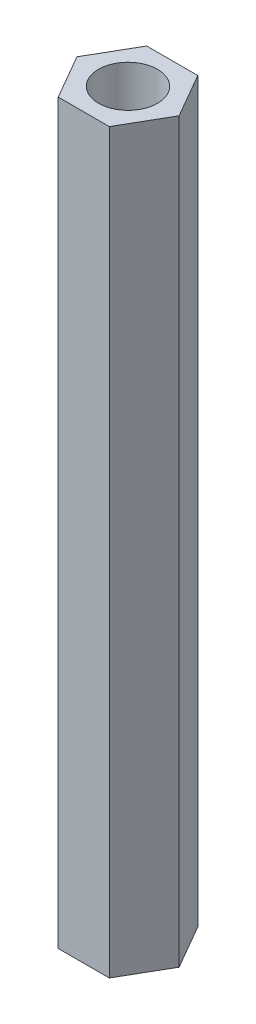
ISO-10303-21;
HEADER;
FILE_DESCRIPTION(('STEP AP214'),'2;1');
FILE_NAME('part.step','',(''),(''),'','','');
FILE_SCHEMA(('AUTOMOTIVE_DESIGN { 1 0 10303 214 1 1 1 1 }'));
ENDSEC;
DATA;
#1=APPLICATION_CONTEXT('core data for automotive mechanical design processes');
#2=APPLICATION_PROTOCOL_DEFINITION('international standard','automotive_design',2000,#1);
#3=PRODUCT_CONTEXT('',#1,'mechanical');
#4=PRODUCT('Part','Part','',(#3));
#5=PRODUCT_RELATED_PRODUCT_CATEGORY('part','',(#4));
#6=PRODUCT_DEFINITION_FORMATION('','',#4);
#7=PRODUCT_DEFINITION_CONTEXT('part definition',#1,'design');
#8=PRODUCT_DEFINITION('design','',#6,#7);
#9=PRODUCT_DEFINITION_SHAPE('','',#8);
#10=(LENGTH_UNIT() NAMED_UNIT(*) SI_UNIT(.MILLI.,.METRE.));
#11=(NAMED_UNIT(*) PLANE_ANGLE_UNIT() SI_UNIT($,.RADIAN.));
#12=(NAMED_UNIT(*) SI_UNIT($,.STERADIAN.) SOLID_ANGLE_UNIT());
#13=UNCERTAINTY_MEASURE_WITH_UNIT(LENGTH_MEASURE(1.E-05),#10,'distance_accuracy_value','');
#14=(GEOMETRIC_REPRESENTATION_CONTEXT(3) GLOBAL_UNCERTAINTY_ASSIGNED_CONTEXT((#13)) GLOBAL_UNIT_ASSIGNED_CONTEXT((#10,
#11,#12)) REPRESENTATION_CONTEXT('',''));
#15=CARTESIAN_POINT('',(0.,0.,0.));
#16=DIRECTION('',(0.,0.,1.));
#17=DIRECTION('',(1.,0.,0.));
#18=AXIS2_PLACEMENT_3D('',#15,#16,#17);
#19=CARTESIAN_POINT('',(0.,50.,0.));
#20=DIRECTION('',(0.,1.,0.));
#21=DIRECTION('',(0.,0.,1.));
#22=AXIS2_PLACEMENT_3D('',#19,#20,#21);
#23=PLANE('',#22);
#24=DIRECTION('',(-0.5,0.,-0.866025403784438));
#25=VECTOR('',#24,1.);
#26=CARTESIAN_POINT('',(3.46410161513775,50.,0.));
#27=LINE('',#26,#25);
#28=CARTESIAN_POINT('',(3.46410161513775,50.,0.));
#29=VERTEX_POINT('',#28);
#30=CARTESIAN_POINT('',(1.73205080756888,50.,-3.));
#31=VERTEX_POINT('',#30);
#32=EDGE_CURVE('E135',#29,#31,#27,.T.);
#33=ORIENTED_EDGE('',*,*,#32,.T.);
#34=DIRECTION('',(-1.,0.,0.));
#35=VECTOR('',#34,1.);
#36=CARTESIAN_POINT('',(1.73205080756888,50.,-3.));
#37=LINE('',#36,#35);
#38=CARTESIAN_POINT('',(-1.73205080756888,50.,-3.));
#39=VERTEX_POINT('',#38);
#40=EDGE_CURVE('E93',#31,#39,#37,.T.);
#41=ORIENTED_EDGE('',*,*,#40,.T.);
#42=DIRECTION('',(-0.499999999999999,0.,0.866025403784439));
#43=VECTOR('',#42,1.);
#44=CARTESIAN_POINT('',(-1.73205080756888,50.,-3.));
#45=LINE('',#44,#43);
#46=CARTESIAN_POINT('',(-3.46410161513775,50.,0.));
#47=VERTEX_POINT('',#46);
#48=EDGE_CURVE('E106',#39,#47,#45,.T.);
#49=ORIENTED_EDGE('',*,*,#48,.T.);
#50=DIRECTION('',(0.5,0.,0.866025403784438));
#51=VECTOR('',#50,1.);
#52=CARTESIAN_POINT('',(-3.46410161513775,50.,0.));
#53=LINE('',#52,#51);
#54=CARTESIAN_POINT('',(-1.73205080756888,50.,3.));
#55=VERTEX_POINT('',#54);
#56=EDGE_CURVE('E100',#47,#55,#53,.T.);
#57=ORIENTED_EDGE('',*,*,#56,.T.);
#58=DIRECTION('',(1.,0.,0.));
#59=VECTOR('',#58,1.);
#60=CARTESIAN_POINT('',(-1.73205080756888,50.,3.));
#61=LINE('',#60,#59);
#62=CARTESIAN_POINT('',(1.73205080756888,50.,3.));
#63=VERTEX_POINT('',#62);
#64=EDGE_CURVE('E104',#55,#63,#61,.T.);
#65=ORIENTED_EDGE('',*,*,#64,.T.);
#66=DIRECTION('',(0.5,0.,-0.866025403784439));
#67=VECTOR('',#66,1.);
#68=CARTESIAN_POINT('',(1.73205080756888,50.,3.));
#69=LINE('',#68,#67);
#70=EDGE_CURVE('E56',#63,#29,#69,.T.);
#71=ORIENTED_EDGE('',*,*,#70,.T.);
#72=EDGE_LOOP('',(#33,#41,#49,#57,#65,#71));
#73=FACE_BOUND('',#72,.T.);
#74=CARTESIAN_POINT('',(0.,50.,0.));
#75=DIRECTION('',(0.,1.,0.));
#76=DIRECTION('',(0.,0.,1.));
#77=AXIS2_PLACEMENT_3D('',#74,#75,#76);
#78=CIRCLE('',#77,2.);
#79=CARTESIAN_POINT('',(0.,50.,2.));
#80=VERTEX_POINT('',#79);
#81=EDGE_CURVE('E128',#80,#80,#78,.T.);
#82=ORIENTED_EDGE('',*,*,#81,.F.);
#83=EDGE_LOOP('',(#82));
#84=FACE_BOUND('',#83,.T.);
#85=ADVANCED_FACE('F39',(#73,#84),#23,.T.);
#86=CARTESIAN_POINT('',(0.,0.,0.));
#87=DIRECTION('',(0.,1.,0.));
#88=DIRECTION('',(0.,0.,1.));
#89=AXIS2_PLACEMENT_3D('',#86,#87,#88);
#90=PLANE('',#89);
#91=DIRECTION('',(-0.5,0.,-0.866025403784438));
#92=VECTOR('',#91,1.);
#93=CARTESIAN_POINT('',(3.46410161513775,0.,0.));
#94=LINE('',#93,#92);
#95=CARTESIAN_POINT('',(3.46410161513775,0.,0.));
#96=VERTEX_POINT('',#95);
#97=CARTESIAN_POINT('',(1.73205080756888,0.,-3.));
#98=VERTEX_POINT('',#97);
#99=EDGE_CURVE('E124',#96,#98,#94,.T.);
#100=ORIENTED_EDGE('',*,*,#99,.F.);
#101=DIRECTION('',(0.5,0.,-0.866025403784439));
#102=VECTOR('',#101,1.);
#103=CARTESIAN_POINT('',(1.73205080756888,0.,3.));
#104=LINE('',#103,#102);
#105=CARTESIAN_POINT('',(1.73205080756888,0.,3.));
#106=VERTEX_POINT('',#105);
#107=EDGE_CURVE('E85',#106,#96,#104,.T.);
#108=ORIENTED_EDGE('',*,*,#107,.F.);
#109=DIRECTION('',(1.,0.,0.));
#110=VECTOR('',#109,1.);
#111=CARTESIAN_POINT('',(-1.73205080756888,0.,3.));
#112=LINE('',#111,#110);
#113=CARTESIAN_POINT('',(-1.73205080756888,0.,3.));
#114=VERTEX_POINT('',#113);
#115=EDGE_CURVE('E79',#114,#106,#112,.T.);
#116=ORIENTED_EDGE('',*,*,#115,.F.);
#117=DIRECTION('',(0.5,0.,0.866025403784438));
#118=VECTOR('',#117,1.);
#119=CARTESIAN_POINT('',(-3.46410161513775,0.,0.));
#120=LINE('',#119,#118);
#121=CARTESIAN_POINT('',(-3.46410161513775,0.,0.));
#122=VERTEX_POINT('',#121);
#123=EDGE_CURVE('E114',#122,#114,#120,.T.);
#124=ORIENTED_EDGE('',*,*,#123,.F.);
#125=DIRECTION('',(-0.499999999999999,0.,0.866025403784439));
#126=VECTOR('',#125,1.);
#127=CARTESIAN_POINT('',(-1.73205080756888,0.,-3.));
#128=LINE('',#127,#126);
#129=CARTESIAN_POINT('',(-1.73205080756888,0.,-3.));
#130=VERTEX_POINT('',#129);
#131=EDGE_CURVE('E130',#130,#122,#128,.T.);
#132=ORIENTED_EDGE('',*,*,#131,.F.);
#133=DIRECTION('',(-1.,0.,0.));
#134=VECTOR('',#133,1.);
#135=CARTESIAN_POINT('',(1.73205080756888,0.,-3.));
#136=LINE('',#135,#134);
#137=EDGE_CURVE('E127',#98,#130,#136,.T.);
#138=ORIENTED_EDGE('',*,*,#137,.F.);
#139=EDGE_LOOP('',(#100,#108,#116,#124,#132,#138));
#140=FACE_BOUND('',#139,.T.);
#141=CARTESIAN_POINT('',(0.,0.,0.));
#142=DIRECTION('',(0.,1.,0.));
#143=DIRECTION('',(0.,0.,1.));
#144=AXIS2_PLACEMENT_3D('',#141,#142,#143);
#145=CIRCLE('',#144,2.);
#146=CARTESIAN_POINT('',(0.,0.,2.));
#147=VERTEX_POINT('',#146);
#148=EDGE_CURVE('E228',#147,#147,#145,.T.);
#149=ORIENTED_EDGE('',*,*,#148,.T.);
#150=EDGE_LOOP('',(#149));
#151=FACE_BOUND('',#150,.T.);
#152=ADVANCED_FACE('F144',(#140,#151),#90,.F.);
#153=CARTESIAN_POINT('',(3.46410161513775,50.,0.));
#154=DIRECTION('',(-0.866025403784438,0.,0.5));
#155=DIRECTION('',(0.5,0.,0.866025403784438));
#156=AXIS2_PLACEMENT_3D('',#153,#154,#155);
#157=PLANE('',#156);
#158=ORIENTED_EDGE('',*,*,#99,.T.);
#159=DIRECTION('',(0.,-1.,0.));
#160=VECTOR('',#159,1.);
#161=CARTESIAN_POINT('',(1.73205080756888,50.,-3.));
#162=LINE('',#161,#160);
#163=EDGE_CURVE('E11',#31,#98,#162,.T.);
#164=ORIENTED_EDGE('',*,*,#163,.F.);
#165=ORIENTED_EDGE('',*,*,#32,.F.);
#166=DIRECTION('',(0.,-1.,0.));
#167=VECTOR('',#166,1.);
#168=CARTESIAN_POINT('',(3.46410161513775,50.,0.));
#169=LINE('',#168,#167);
#170=EDGE_CURVE('E120',#29,#96,#169,.T.);
#171=ORIENTED_EDGE('',*,*,#170,.T.);
#172=EDGE_LOOP('',(#158,#164,#165,#171));
#173=FACE_BOUND('',#172,.T.);
#174=ADVANCED_FACE('F41',(#173),#157,.F.);
#175=CARTESIAN_POINT('',(1.73205080756888,50.,-3.));
#176=DIRECTION('',(0.,0.,1.));
#177=DIRECTION('',(1.,0.,0.));
#178=AXIS2_PLACEMENT_3D('',#175,#176,#177);
#179=PLANE('',#178);
#180=ORIENTED_EDGE('',*,*,#137,.T.);
#181=DIRECTION('',(0.,-1.,0.));
#182=VECTOR('',#181,1.);
#183=CARTESIAN_POINT('',(-1.73205080756888,50.,-3.));
#184=LINE('',#183,#182);
#185=EDGE_CURVE('E48',#39,#130,#184,.T.);
#186=ORIENTED_EDGE('',*,*,#185,.F.);
#187=ORIENTED_EDGE('',*,*,#40,.F.);
#188=ORIENTED_EDGE('',*,*,#163,.T.);
#189=EDGE_LOOP('',(#180,#186,#187,#188));
#190=FACE_BOUND('',#189,.T.);
#191=ADVANCED_FACE('F169',(#190),#179,.F.);
#192=CARTESIAN_POINT('',(-1.73205080756888,50.,-3.));
#193=DIRECTION('',(0.866025403784439,0.,0.499999999999999));
#194=DIRECTION('',(0.5,0.,-0.866025403784439));
#195=AXIS2_PLACEMENT_3D('',#192,#193,#194);
#196=PLANE('',#195);
#197=ORIENTED_EDGE('',*,*,#131,.T.);
#198=DIRECTION('',(0.,-1.,0.));
#199=VECTOR('',#198,1.);
#200=CARTESIAN_POINT('',(-3.46410161513775,50.,0.));
#201=LINE('',#200,#199);
#202=EDGE_CURVE('E115',#47,#122,#201,.T.);
#203=ORIENTED_EDGE('',*,*,#202,.F.);
#204=ORIENTED_EDGE('',*,*,#48,.F.);
#205=ORIENTED_EDGE('',*,*,#185,.T.);
#206=EDGE_LOOP('',(#197,#203,#204,#205));
#207=FACE_BOUND('',#206,.T.);
#208=ADVANCED_FACE('F141',(#207),#196,.F.);
#209=CARTESIAN_POINT('',(-3.46410161513775,50.,0.));
#210=DIRECTION('',(0.866025403784438,0.,-0.5));
#211=DIRECTION('',(-0.5,0.,-0.866025403784439));
#212=AXIS2_PLACEMENT_3D('',#209,#210,#211);
#213=PLANE('',#212);
#214=ORIENTED_EDGE('',*,*,#123,.T.);
#215=DIRECTION('',(0.,-1.,0.));
#216=VECTOR('',#215,1.);
#217=CARTESIAN_POINT('',(-1.73205080756888,50.,3.));
#218=LINE('',#217,#216);
#219=EDGE_CURVE('E111',#55,#114,#218,.T.);
#220=ORIENTED_EDGE('',*,*,#219,.F.);
#221=ORIENTED_EDGE('',*,*,#56,.F.);
#222=ORIENTED_EDGE('',*,*,#202,.T.);
#223=EDGE_LOOP('',(#214,#220,#221,#222));
#224=FACE_BOUND('',#223,.T.);
#225=ADVANCED_FACE('F112',(#224),#213,.F.);
#226=CARTESIAN_POINT('',(-1.73205080756888,50.,3.));
#227=DIRECTION('',(0.,0.,-1.));
#228=DIRECTION('',(-1.,0.,0.));
#229=AXIS2_PLACEMENT_3D('',#226,#227,#228);
#230=PLANE('',#229);
#231=ORIENTED_EDGE('',*,*,#115,.T.);
#232=DIRECTION('',(0.,-1.,0.));
#233=VECTOR('',#232,1.);
#234=CARTESIAN_POINT('',(1.73205080756888,50.,3.));
#235=LINE('',#234,#233);
#236=EDGE_CURVE('E116',#63,#106,#235,.T.);
#237=ORIENTED_EDGE('',*,*,#236,.F.);
#238=ORIENTED_EDGE('',*,*,#64,.F.);
#239=ORIENTED_EDGE('',*,*,#219,.T.);
#240=EDGE_LOOP('',(#231,#237,#238,#239));
#241=FACE_BOUND('',#240,.T.);
#242=ADVANCED_FACE('F118',(#241),#230,.F.);
#243=CARTESIAN_POINT('',(1.73205080756888,50.,3.));
#244=DIRECTION('',(-0.866025403784439,0.,-0.5));
#245=DIRECTION('',(-0.5,0.,0.866025403784439));
#246=AXIS2_PLACEMENT_3D('',#243,#244,#245);
#247=PLANE('',#246);
#248=ORIENTED_EDGE('',*,*,#107,.T.);
#249=ORIENTED_EDGE('',*,*,#170,.F.);
#250=ORIENTED_EDGE('',*,*,#70,.F.);
#251=ORIENTED_EDGE('',*,*,#236,.T.);
#252=EDGE_LOOP('',(#248,#249,#250,#251));
#253=FACE_BOUND('',#252,.T.);
#254=ADVANCED_FACE('F149',(#253),#247,.F.);
#255=CARTESIAN_POINT('',(0.,50.,0.));
#256=DIRECTION('',(0.,-1.,0.));
#257=DIRECTION('',(0.,0.,-1.));
#258=AXIS2_PLACEMENT_3D('',#255,#256,#257);
#259=CYLINDRICAL_SURFACE('',#258,2.);
#260=ORIENTED_EDGE('',*,*,#81,.T.);
#261=EDGE_LOOP('',(#260));
#262=FACE_BOUND('',#261,.T.);
#263=ORIENTED_EDGE('',*,*,#148,.F.);
#264=EDGE_LOOP('',(#263));
#265=FACE_BOUND('',#264,.T.);
#266=ADVANCED_FACE('F151',(#262,#265),#259,.F.);
#267=CLOSED_SHELL('',(#85,#152,#174,#191,#208,#225,#242,#254,#266));
#268=MANIFOLD_SOLID_BREP('B2',#267);
#269=ADVANCED_BREP_SHAPE_REPRESENTATION('',(#18,#268),#14);
#270=SHAPE_DEFINITION_REPRESENTATION(#9,#269);
ENDSEC;
END-ISO-10303-21;
